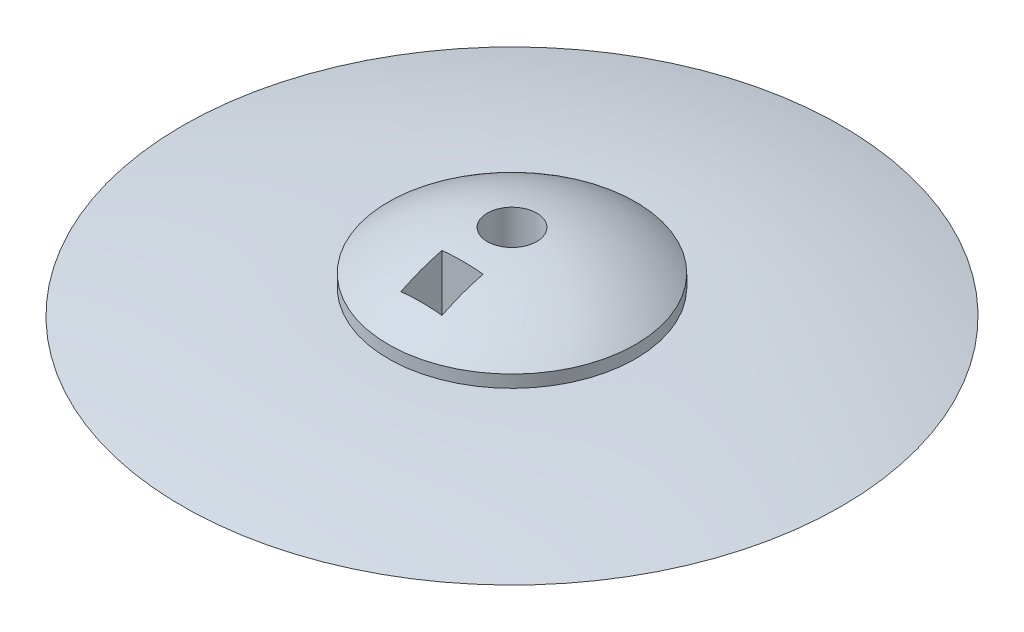
ISO-10303-21;
HEADER;
FILE_DESCRIPTION(('STEP AP214'),'2;1');
FILE_NAME('part.step','',(''),(''),'','','');
FILE_SCHEMA(('AUTOMOTIVE_DESIGN { 1 0 10303 214 1 1 1 1 }'));
ENDSEC;
DATA;
#1=APPLICATION_CONTEXT('core data for automotive mechanical design processes');
#2=APPLICATION_PROTOCOL_DEFINITION('international standard','automotive_design',2000,#1);
#3=PRODUCT_CONTEXT('',#1,'mechanical');
#4=PRODUCT('Part','Part','',(#3));
#5=PRODUCT_RELATED_PRODUCT_CATEGORY('part','',(#4));
#6=PRODUCT_DEFINITION_FORMATION('','',#4);
#7=PRODUCT_DEFINITION_CONTEXT('part definition',#1,'design');
#8=PRODUCT_DEFINITION('design','',#6,#7);
#9=PRODUCT_DEFINITION_SHAPE('','',#8);
#10=(LENGTH_UNIT() NAMED_UNIT(*) SI_UNIT(.MILLI.,.METRE.));
#11=(NAMED_UNIT(*) PLANE_ANGLE_UNIT() SI_UNIT($,.RADIAN.));
#12=(NAMED_UNIT(*) SI_UNIT($,.STERADIAN.) SOLID_ANGLE_UNIT());
#13=UNCERTAINTY_MEASURE_WITH_UNIT(LENGTH_MEASURE(1.E-05),#10,'distance_accuracy_value','');
#14=(GEOMETRIC_REPRESENTATION_CONTEXT(3) GLOBAL_UNCERTAINTY_ASSIGNED_CONTEXT((#13)) GLOBAL_UNIT_ASSIGNED_CONTEXT((#10,
#11,#12)) REPRESENTATION_CONTEXT('',''));
#15=CARTESIAN_POINT('',(0.,0.,0.));
#16=DIRECTION('',(0.,0.,1.));
#17=DIRECTION('',(1.,0.,0.));
#18=AXIS2_PLACEMENT_3D('',#15,#16,#17);
#19=CARTESIAN_POINT('',(0.,19.05,0.));
#20=DIRECTION('',(0.,-1.,0.));
#21=DIRECTION('',(1.,0.,0.));
#22=AXIS2_PLACEMENT_3D('',#19,#20,#21);
#23=CYLINDRICAL_SURFACE('',#22,3.81);
#24=CARTESIAN_POINT('',(0.,18.8205710608168,0.));
#25=DIRECTION('',(0.,-1.,0.));
#26=DIRECTION('',(1.,0.,0.));
#27=AXIS2_PLACEMENT_3D('',#24,#25,#26);
#28=CIRCLE('',#27,3.81);
#29=CARTESIAN_POINT('',(3.81,18.8205710608168,0.));
#30=VERTEX_POINT('',#29);
#31=EDGE_CURVE('E110',#30,#30,#28,.F.);
#32=ORIENTED_EDGE('',*,*,#31,.T.);
#33=EDGE_LOOP('',(#32));
#34=FACE_BOUND('',#33,.T.);
#35=CARTESIAN_POINT('',(0.,0.638751879125377,0.));
#36=DIRECTION('',(0.,1.,0.));
#37=DIRECTION('',(-1.,0.,0.));
#38=AXIS2_PLACEMENT_3D('',#35,#36,#37);
#39=CIRCLE('',#38,3.81);
#40=CARTESIAN_POINT('',(-3.81,0.638751879125377,0.));
#41=VERTEX_POINT('',#40);
#42=EDGE_CURVE('E105',#41,#41,#39,.F.);
#43=ORIENTED_EDGE('',*,*,#42,.T.);
#44=EDGE_LOOP('',(#43));
#45=FACE_BOUND('',#44,.T.);
#46=CARTESIAN_POINT('',(1.84450831863129,5.08,3.33375));
#47=CARTESIAN_POINT('',(1.84450485690147,4.97495957982358,3.33375667884058));
#48=CARTESIAN_POINT('',(1.83663504261278,4.86980296629292,3.33814394288497));
#49=CARTESIAN_POINT('',(1.8052511738438,4.66242101605275,3.35521580649338));
#50=CARTESIAN_POINT('',(1.78170911181393,4.56020126952595,3.36791525991533));
#51=CARTESIAN_POINT('',(1.71939778935129,4.36183647030819,3.4001457989546));
#52=CARTESIAN_POINT('',(1.68065346990357,4.26568176565757,3.41966568917617));
#53=CARTESIAN_POINT('',(1.5885835744515,4.08183214581293,3.46339243590433));
#54=CARTESIAN_POINT('',(1.53526129365898,3.99413532484628,3.48759823284501));
#55=CARTESIAN_POINT('',(1.41398427515898,3.82805396695452,3.53852098701009));
#56=CARTESIAN_POINT('',(1.34581071222825,3.74983933828346,3.56527170503102));
#57=CARTESIAN_POINT('',(1.19668563983482,3.60639097370986,3.61805011069635));
#58=CARTESIAN_POINT('',(1.11573356157362,3.54115781593215,3.64407776609505));
#59=CARTESIAN_POINT('',(0.943608465451337,3.42591076716566,3.6923730850343));
#60=CARTESIAN_POINT('',(0.8525225861647,3.37577906298058,3.71466921792614));
#61=CARTESIAN_POINT('',(0.66205787037869,3.29150991533011,3.75329208711571));
#62=CARTESIAN_POINT('',(0.562681968839975,3.25736683940039,3.76962092512264));
#63=CARTESIAN_POINT('',(0.363975533301578,3.20746913104421,3.79382628797596));
#64=CARTESIAN_POINT('',(0.26490888480565,3.19085419123302,3.8020965553522));
#65=CARTESIAN_POINT('',(0.0650639188767099,3.17346841726746,3.81075560099529));
#66=CARTESIAN_POINT('',(-0.0357139298198702,3.17269331212266,3.81114650382247));
#67=CARTESIAN_POINT('',(-0.2317060868341,3.18670394305774,3.80416062344571));
#68=CARTESIAN_POINT('',(-0.326978572868285,3.20085002508652,3.79710313703066));
#69=CARTESIAN_POINT('',(-0.513553278900913,3.24331305970202,3.77639712415501));
#70=CARTESIAN_POINT('',(-0.604855484463092,3.27163006381069,3.76274857373096));
#71=CARTESIAN_POINT('',(-0.781996051852397,3.34202720406553,3.72998415400345));
#72=CARTESIAN_POINT('',(-0.867771491637588,3.38424060459465,3.71081558067993));
#73=CARTESIAN_POINT('',(-1.03086876907161,3.48129315189791,3.66885684881573));
#74=CARTESIAN_POINT('',(-1.10818873910302,3.53613507974701,3.64606589289101));
#75=CARTESIAN_POINT('',(-1.25643409152258,3.66022302424384,3.59775726408616));
#76=CARTESIAN_POINT('',(-1.32684445585705,3.73005339420716,3.57216017023125));
#77=CARTESIAN_POINT('',(-1.45526450553079,3.88058359872348,3.52179991827897));
#78=CARTESIAN_POINT('',(-1.51327085199886,3.96128635036221,3.49703698622581));
#79=CARTESIAN_POINT('',(-1.61814451808316,4.13541078307971,3.44980724644181));
#80=CARTESIAN_POINT('',(-1.66441235918467,4.22923483692372,3.4274885997958));
#81=CARTESIAN_POINT('',(-1.74155317654316,4.4241850780795,3.38894732879071));
#82=CARTESIAN_POINT('',(-1.77242671411818,4.52531099899145,3.37272448216756));
#83=CARTESIAN_POINT('',(-1.81820540356248,4.73177739303201,3.34826956312067));
#84=CARTESIAN_POINT('',(-1.83315195664297,4.83710619708719,3.34001677827921));
#85=CARTESIAN_POINT('',(-1.84696197853558,5.04912437316591,3.33240118098069));
#86=CARTESIAN_POINT('',(-1.84582755520348,5.15581356504146,3.33303720339996));
#87=CARTESIAN_POINT('',(-1.82770236707949,5.3650635864275,3.34300790332365));
#88=CARTESIAN_POINT('',(-1.81105714882204,5.4676637328227,3.35215301043595));
#89=CARTESIAN_POINT('',(-1.7626725566967,5.6682718040062,3.37784371993086));
#90=CARTESIAN_POINT('',(-1.73093203987156,5.76627938044561,3.39438988268696));
#91=CARTESIAN_POINT('',(-1.65250096886245,5.95598204357754,3.43325839795897));
#92=CARTESIAN_POINT('',(-1.60567466149725,6.0476102514737,3.45563283348314));
#93=CARTESIAN_POINT('',(-1.49793524768189,6.22122715231448,3.50367787490109));
#94=CARTESIAN_POINT('',(-1.43701989192785,6.30321430291703,3.52934900681812));
#95=CARTESIAN_POINT('',(-1.30081825284457,6.45706107432266,3.58181432889784));
#96=CARTESIAN_POINT('',(-1.22526430981437,6.5286801513278,3.60862074514845));
#97=CARTESIAN_POINT('',(-1.06225217787024,6.6578432554888,3.65991888308245));
#98=CARTESIAN_POINT('',(-0.974795266905234,6.71538879178217,3.68441085277619));
#99=CARTESIAN_POINT('',(-0.792277721982926,6.8136481918348,3.72786666133346));
#100=CARTESIAN_POINT('',(-0.697432841291562,6.85471212243134,3.74694263530313));
#101=CARTESIAN_POINT('',(-0.501188586203321,6.92058979309999,3.77819568149009));
#102=CARTESIAN_POINT('',(-0.399791694114236,6.94540964823184,3.79037534957907));
#103=CARTESIAN_POINT('',(-0.19936145619968,6.97711501188611,3.80603480550194));
#104=CARTESIAN_POINT('',(-0.100506765752344,6.98491514920616,3.80995785031155));
#105=CARTESIAN_POINT('',(0.0972089253695492,6.98508342375894,3.81004143622459));
#106=CARTESIAN_POINT('',(0.196069921104734,6.97745455267239,3.8062034821837));
#107=CARTESIAN_POINT('',(0.387986247832529,6.94744703769766,3.7913807313503));
#108=CARTESIAN_POINT('',(0.481126807369104,6.9255041253209,3.78060718336952));
#109=CARTESIAN_POINT('',(0.662130757989706,6.86789961892237,3.7531410298415));
#110=CARTESIAN_POINT('',(0.749993737115049,6.8322369555656,3.73644796292729));
#111=CARTESIAN_POINT('',(0.920326547934199,6.74708916107425,3.69822988239512));
#112=CARTESIAN_POINT('',(1.002617060096,6.69729374694641,3.676598821668));
#113=CARTESIAN_POINT('',(1.1576177088484,6.58548606746018,3.63078003479306));
#114=CARTESIAN_POINT('',(1.23032596857911,6.52347141465726,3.60659180944473));
#115=CARTESIAN_POINT('',(1.36839433409533,6.38499920952268,3.55658264065951));
#116=CARTESIAN_POINT('',(1.43314958966442,6.30794460364378,3.53074380896368));
#117=CARTESIAN_POINT('',(1.54931880767525,6.14365242816526,3.48133735676198));
#118=CARTESIAN_POINT('',(1.60072492060363,6.05640891082944,3.45777107765046));
#119=CARTESIAN_POINT('',(1.69080210391312,5.87081970569292,3.41465595160386));
#120=CARTESIAN_POINT('',(1.72898387382655,5.77219839404328,3.39526986111089));
#121=CARTESIAN_POINT('',(1.78942298838729,5.56921451450615,3.36381388446616));
#122=CARTESIAN_POINT('',(1.81171040925096,5.46486319461244,3.35173018695062));
#123=CARTESIAN_POINT('',(1.83209478699778,5.31303201091727,3.34059367416096));
#124=CARTESIAN_POINT('',(1.83674682003083,5.2665916832096,3.33803446016504));
#125=CARTESIAN_POINT('',(1.84295436652178,5.17344190450239,3.33461113156774));
#126=CARTESIAN_POINT('',(1.84450985875385,5.12673245166026,3.33374702858581));
#127=CARTESIAN_POINT('',(1.84450831863129,5.08,3.33375));
#128=B_SPLINE_CURVE_WITH_KNOTS('',3,(#46,#47,#48,#49,#50,#51,#52,#53,#54,#55,#56,#57,#58,#59,
#60,#61,#62,#63,#64,#65,#66,#67,#68,#69,#70,#71,#72,#73,#74,#75,#76,#77,#78,#79,#80,#81,#82,#83,
#84,#85,#86,#87,#88,#89,#90,#91,#92,#93,#94,#95,#96,#97,#98,#99,#100,#101,#102,#103,#104,#105,
#106,#107,#108,#109,#110,#111,#112,#113,#114,#115,#116,#117,#118,#119,#120,#121,#122,#123,#124,
#125,#126,#127),.UNSPECIFIED.,.T.,.F.,(4,2,2,2,2,2,2,2,2,2,2,2,2,2,2,2,2,2,2,2,2,2,2,2,2,2,2,2,
2,2,2,2,2,2,2,2,2,2,2,2,4),(0.,0.31494295189275,0.630450248140965,0.945442069652593,
1.26036274899366,1.58028213742867,1.90021577016374,2.21758465255067,2.53484164815617,
2.83567754593717,3.13643232644486,3.42479866710733,3.71316605620569,4.00438358060209,
4.29566529883627,4.60155207819422,4.90752109175442,5.22689734709262,5.54626195625501,
5.8647943564509,6.18328500457049,6.49484578881822,6.80643016699233,7.12090063024874,
7.43542133312796,7.75635411231235,8.07725246204692,8.39091963275994,8.70446865587854,
9.00070399555714,9.29688190078757,9.58443999741617,9.87202051123412,10.1664812455013,
10.4609995698566,10.7713449179785,11.0818723430982,11.4028980400582,11.7233146498969,
11.8634317149623,12.0035497404838),.UNSPECIFIED.);
#129=CARTESIAN_POINT('',(1.84450831863129,5.08,3.33375));
#130=VERTEX_POINT('',#129);
#131=EDGE_CURVE('E11',#130,#130,#128,.T.);
#132=ORIENTED_EDGE('',*,*,#131,.F.);
#133=EDGE_LOOP('',(#132));
#134=FACE_BOUND('',#133,.T.);
#135=ADVANCED_FACE('F39',(#34,#45,#134),#23,.F.);
#136=CARTESIAN_POINT('',(0.,-12.7,0.));
#137=DIRECTION('',(0.,-1.,0.));
#138=DIRECTION('',(1.,0.,0.));
#139=AXIS2_PLACEMENT_3D('',#136,#137,#138);
#140=SPHERICAL_SURFACE('',#139,31.75);
#141=ORIENTED_EDGE('',*,*,#31,.F.);
#142=EDGE_LOOP('',(#141));
#143=FACE_BOUND('',#142,.T.);
#144=CARTESIAN_POINT('',(3.175,-12.7,0.));
#145=DIRECTION('',(1.,0.,0.));
#146=DIRECTION('',(0.,1.,0.));
#147=AXIS2_PLACEMENT_3D('',#144,#145,#146);
#148=CIRCLE('',#147,31.5908511281352);
#149=CARTESIAN_POINT('',(3.175,15.6340956270003,13.97));
#150=VERTEX_POINT('',#149);
#151=CARTESIAN_POINT('',(3.175,17.9580735696162,7.62));
#152=VERTEX_POINT('',#151);
#153=EDGE_CURVE('E95',#150,#152,#148,.F.);
#154=ORIENTED_EDGE('',*,*,#153,.F.);
#155=CARTESIAN_POINT('',(0.,-12.7,13.97));
#156=DIRECTION('',(0.,0.,1.));
#157=DIRECTION('',(1.,0.,0.));
#158=AXIS2_PLACEMENT_3D('',#155,#156,#157);
#159=CIRCLE('',#158,28.5114292872174);
#160=CARTESIAN_POINT('',(-3.175,15.6340956270003,13.97));
#161=VERTEX_POINT('',#160);
#162=EDGE_CURVE('E83',#161,#150,#159,.F.);
#163=ORIENTED_EDGE('',*,*,#162,.F.);
#164=CARTESIAN_POINT('',(-3.175,-12.7,0.));
#165=DIRECTION('',(-1.,0.,0.));
#166=DIRECTION('',(0.,-1.,0.));
#167=AXIS2_PLACEMENT_3D('',#164,#165,#166);
#168=CIRCLE('',#167,31.5908511281352);
#169=CARTESIAN_POINT('',(-3.175,17.9580735696162,7.62));
#170=VERTEX_POINT('',#169);
#171=EDGE_CURVE('E89',#170,#161,#168,.F.);
#172=ORIENTED_EDGE('',*,*,#171,.F.);
#173=CARTESIAN_POINT('',(0.,-12.7,7.62));
#174=DIRECTION('',(0.,0.,-1.));
#175=DIRECTION('',(-1.,0.,0.));
#176=AXIS2_PLACEMENT_3D('',#173,#174,#175);
#177=CIRCLE('',#176,30.8220391927594);
#178=EDGE_CURVE('E103',#152,#170,#177,.F.);
#179=ORIENTED_EDGE('',*,*,#178,.F.);
#180=EDGE_LOOP('',(#154,#163,#172,#179));
#181=FACE_BOUND('',#180,.T.);
#182=CARTESIAN_POINT('',(0.,12.7,0.));
#183=DIRECTION('',(0.,-1.,0.));
#184=DIRECTION('',(1.,0.,0.));
#185=AXIS2_PLACEMENT_3D('',#182,#183,#184);
#186=CIRCLE('',#185,19.05);
#187=CARTESIAN_POINT('',(19.05,12.7,0.));
#188=VERTEX_POINT('',#187);
#189=EDGE_CURVE('E133',#188,#188,#186,.T.);
#190=ORIENTED_EDGE('',*,*,#189,.F.);
#191=EDGE_LOOP('',(#190));
#192=FACE_BOUND('',#191,.T.);
#193=ADVANCED_FACE('F41',(#143,#181,#192),#140,.T.);
#194=CARTESIAN_POINT('',(0.,0.,0.));
#195=DIRECTION('',(0.,-1.,0.));
#196=DIRECTION('',(1.,0.,0.));
#197=AXIS2_PLACEMENT_3D('',#194,#195,#196);
#198=CYLINDRICAL_SURFACE('',#197,19.05);
#199=ORIENTED_EDGE('',*,*,#189,.T.);
#200=EDGE_LOOP('',(#199));
#201=FACE_BOUND('',#200,.T.);
#202=CARTESIAN_POINT('',(0.,10.795,0.));
#203=DIRECTION('',(0.,-1.,0.));
#204=DIRECTION('',(1.,0.,0.));
#205=AXIS2_PLACEMENT_3D('',#202,#203,#204);
#206=CIRCLE('',#205,19.05);
#207=CARTESIAN_POINT('',(19.05,10.795,0.));
#208=VERTEX_POINT('',#207);
#209=EDGE_CURVE('E129',#208,#208,#206,.T.);
#210=ORIENTED_EDGE('',*,*,#209,.F.);
#211=EDGE_LOOP('',(#210));
#212=FACE_BOUND('',#211,.T.);
#213=ADVANCED_FACE('F239',(#201,#212),#198,.T.);
#214=CARTESIAN_POINT('',(0.,-123.401666666666,0.));
#215=DIRECTION('',(0.,-1.,0.));
#216=DIRECTION('',(1.,0.,0.));
#217=AXIS2_PLACEMENT_3D('',#214,#215,#216);
#218=DEGENERATE_TOROIDAL_SURFACE('',#217,19.05,134.196666666666,.T.);
#219=ORIENTED_EDGE('',*,*,#209,.T.);
#220=EDGE_LOOP('',(#219));
#221=FACE_BOUND('',#220,.T.);
#222=CARTESIAN_POINT('',(0.,6.985,0.));
#223=DIRECTION('',(0.,-1.,0.));
#224=DIRECTION('',(1.,0.,0.));
#225=AXIS2_PLACEMENT_3D('',#222,#223,#224);
#226=CIRCLE('',#225,50.8);
#227=CARTESIAN_POINT('',(50.8,6.985,0.));
#228=VERTEX_POINT('',#227);
#229=EDGE_CURVE('E125',#228,#228,#226,.T.);
#230=ORIENTED_EDGE('',*,*,#229,.F.);
#231=EDGE_LOOP('',(#230));
#232=FACE_BOUND('',#231,.T.);
#233=ADVANCED_FACE('F231',(#221,#232),#218,.T.);
#234=CARTESIAN_POINT('',(0.,137.371666666666,0.));
#235=DIRECTION('',(0.,-1.,0.));
#236=DIRECTION('',(1.,0.,0.));
#237=AXIS2_PLACEMENT_3D('',#234,#235,#236);
#238=DEGENERATE_TOROIDAL_SURFACE('',#237,19.05,134.196666666666,.T.);
#239=ORIENTED_EDGE('',*,*,#229,.T.);
#240=EDGE_LOOP('',(#239));
#241=FACE_BOUND('',#240,.T.);
#242=CARTESIAN_POINT('',(0.,3.17499999999998,0.));
#243=DIRECTION('',(0.,-1.,0.));
#244=DIRECTION('',(1.,0.,0.));
#245=AXIS2_PLACEMENT_3D('',#242,#243,#244);
#246=CIRCLE('',#245,19.05);
#247=CARTESIAN_POINT('',(19.05,3.17499999999998,0.));
#248=VERTEX_POINT('',#247);
#249=EDGE_CURVE('E121',#248,#248,#246,.T.);
#250=ORIENTED_EDGE('',*,*,#249,.F.);
#251=EDGE_LOOP('',(#250));
#252=FACE_BOUND('',#251,.T.);
#253=ADVANCED_FACE('F224',(#241,#252),#238,.T.);
#254=CARTESIAN_POINT('',(0.,0.,0.));
#255=DIRECTION('',(0.,-1.,0.));
#256=DIRECTION('',(1.,0.,0.));
#257=AXIS2_PLACEMENT_3D('',#254,#255,#256);
#258=CYLINDRICAL_SURFACE('',#257,19.05);
#259=ORIENTED_EDGE('',*,*,#249,.T.);
#260=EDGE_LOOP('',(#259));
#261=FACE_BOUND('',#260,.T.);
#262=CARTESIAN_POINT('',(0.,1.27,0.));
#263=DIRECTION('',(0.,-1.,0.));
#264=DIRECTION('',(1.,0.,0.));
#265=AXIS2_PLACEMENT_3D('',#262,#263,#264);
#266=CIRCLE('',#265,19.05);
#267=CARTESIAN_POINT('',(19.05,1.27,0.));
#268=VERTEX_POINT('',#267);
#269=EDGE_CURVE('E117',#268,#268,#266,.T.);
#270=ORIENTED_EDGE('',*,*,#269,.F.);
#271=EDGE_LOOP('',(#270));
#272=FACE_BOUND('',#271,.T.);
#273=ADVANCED_FACE('F216',(#261,#272),#258,.T.);
#274=CARTESIAN_POINT('',(0.,215.582500000007,0.));
#275=DIRECTION('',(0.,-1.,0.));
#276=DIRECTION('',(1.,0.,0.));
#277=AXIS2_PLACEMENT_3D('',#274,#275,#276);
#278=DEGENERATE_TOROIDAL_SURFACE('',#277,2.54,214.947500000007,.T.);
#279=ORIENTED_EDGE('',*,*,#42,.F.);
#280=EDGE_LOOP('',(#279));
#281=FACE_BOUND('',#280,.T.);
#282=CARTESIAN_POINT('',(3.175,0.636752065188605,1.23812898058823));
#283=CARTESIAN_POINT('',(3.175,0.637164448259013,1.52210864355336));
#284=CARTESIAN_POINT('',(3.175,0.63778279088176,1.80608821100459));
#285=CARTESIAN_POINT('',(3.175,0.639617154586712,2.37404472379576));
#286=CARTESIAN_POINT('',(3.175,0.64083317435017,2.6580216691401));
#287=CARTESIAN_POINT('',(3.175,0.645656728011568,3.51000639647914));
#288=CARTESIAN_POINT('',(3.175,0.650439747722854,4.07800847686724));
#289=CARTESIAN_POINT('',(3.175,0.663907664854034,5.21429069613779));
#290=CARTESIAN_POINT('',(3.175,0.67259477929062,5.78257080949005));
#291=CARTESIAN_POINT('',(3.175,0.694164393825613,6.91905163436281));
#292=CARTESIAN_POINT('',(3.175,0.707046902225045,7.48725234572398));
#293=CARTESIAN_POINT('',(3.175,0.752207104840167,9.19170126642365));
#294=CARTESIAN_POINT('',(3.175,0.790997352068051,10.3277851624842));
#295=CARTESIAN_POINT('',(3.175,0.886348417419106,12.5991394888651));
#296=CARTESIAN_POINT('',(3.175,0.942908270409936,13.73440996001));
#297=CARTESIAN_POINT('',(3.175,1.07390357586904,16.0039026830258));
#298=CARTESIAN_POINT('',(3.175,1.14833862792265,17.1381249578058));
#299=CARTESIAN_POINT('',(3.175,1.25724583351075,18.6185088993154));
#300=CARTESIAN_POINT('',(3.175,1.28359986884597,18.9652803937067));
#301=CARTESIAN_POINT('',(3.175,1.33798434876787,19.6586811148859));
#302=CARTESIAN_POINT('',(3.175,1.36601474150613,20.0053103457405));
#303=CARTESIAN_POINT('',(3.175,1.39488382248361,20.3518710194118));
#304=B_SPLINE_CURVE_WITH_KNOTS('',3,(#282,#283,#284,#285,#286,#287,#288,#289,#290,#291,#292,
#293,#294,#295,#296,#297,#298,#299,#300,#301,#302,#303),.UNSPECIFIED.,.F.,.F.,(4,2,2,2,2,2,2,2,
2,2,4),(0.,0.851940026993077,1.7038781742272,3.40793324537895,5.11295722274075,6.81798457369035,
10.2280725739496,13.6379753918563,17.0478018331171,18.0911135127384,19.1343929402163),.UNSPECIFIED.);
#305=CARTESIAN_POINT('',(3.175,0.710988320926989,7.62));
#306=VERTEX_POINT('',#305);
#307=CARTESIAN_POINT('',(3.17499999998456,0.958382071733302,13.97));
#308=VERTEX_POINT('',#307);
#309=EDGE_CURVE('E53',#306,#308,#304,.T.);
#310=ORIENTED_EDGE('',*,*,#309,.F.);
#311=CARTESIAN_POINT('',(-9.55687101941177,0.853205128924648,7.62));
#312=CARTESIAN_POINT('',(-9.04736694067312,0.835234158952985,7.62));
#313=CARTESIAN_POINT('',(-8.53780457040987,0.818943601130382,7.62));
#314=CARTESIAN_POINT('',(-7.51858958133881,0.789592792878166,7.62));
#315=CARTESIAN_POINT('',(-7.00893696306341,0.776532523988091,7.62));
#316=CARTESIAN_POINT('',(-5.98956938565687,0.753511741331376,7.62));
#317=CARTESIAN_POINT('',(-5.47985442753786,0.743551182579588,7.62));
#318=CARTESIAN_POINT('',(-4.46037602436344,0.726554492240761,7.62));
#319=CARTESIAN_POINT('',(-3.95061257924434,0.719518364550027,7.62));
#320=CARTESIAN_POINT('',(-2.42164265103105,0.702456197364192,7.62));
#321=CARTESIAN_POINT('',(-1.40238848764771,0.69646837439253,7.62));
#322=CARTESIAN_POINT('',(0.126495596809321,0.694664362994788,7.62));
#323=CARTESIAN_POINT('',(0.636125907314031,0.695259327891017,7.62));
#324=CARTESIAN_POINT('',(1.65537782891867,0.69890059262657,7.62));
#325=CARTESIAN_POINT('',(2.16499944003194,0.701946888294366,7.62));
#326=CARTESIAN_POINT('',(3.24820358225854,0.711190931021181,7.62));
#327=CARTESIAN_POINT('',(3.82178320291763,0.717736329833887,7.62));
#328=CARTESIAN_POINT('',(4.96888475552411,0.734427258056155,7.62));
#329=CARTESIAN_POINT('',(5.5424066880039,0.744572750458096,7.62));
#330=CARTESIAN_POINT('',(6.68948300191234,0.76874131075022,7.62));
#331=CARTESIAN_POINT('',(7.26303736733195,0.782765144998229,7.62));
#332=CARTESIAN_POINT('',(8.4100427372904,0.814883581912772,7.62));
#333=CARTESIAN_POINT('',(8.98349373966834,0.832978261592738,7.62));
#334=CARTESIAN_POINT('',(9.55687101941177,0.853205128924619,7.62));
#335=B_SPLINE_CURVE_WITH_KNOTS('',3,(#311,#312,#313,#314,#315,#316,#317,#318,#319,#320,#321,
#322,#323,#324,#325,#326,#327,#328,#329,#330,#331,#332,#333,#334),.UNSPECIFIED.,.F.,.F.,(4,2,2,
2,2,2,2,2,2,2,2,4),(0.,1.52945850062833,3.05890826050216,4.58833582290284,6.11776542299827,
9.17552015695002,10.7044083786471,12.2332939985794,13.9541345320142,15.6749573763616,
17.3961204974396,19.117316182718),.UNSPECIFIED.);
#336=CARTESIAN_POINT('',(-3.175,0.710988320927006,7.62));
#337=VERTEX_POINT('',#336);
#338=EDGE_CURVE('E172',#337,#306,#335,.T.);
#339=ORIENTED_EDGE('',*,*,#338,.F.);
#340=CARTESIAN_POINT('',(-3.175,1.39488382248362,20.3518710194118));
#341=CARTESIAN_POINT('',(-3.175,1.32868084517738,19.5571537874065));
#342=CARTESIAN_POINT('',(-3.175,1.26689096346016,18.7620691185354));
#343=CARTESIAN_POINT('',(-3.175,1.1521267691735,17.1712597370884));
#344=CARTESIAN_POINT('',(-3.175,1.099152501133,16.3755350213));
#345=CARTESIAN_POINT('',(-3.175,1.00203169434276,14.7839108058663));
#346=CARTESIAN_POINT('',(-3.175,0.957881147487458,13.9880115507341));
#347=CARTESIAN_POINT('',(-3.175,0.878350239191124,12.395778518779));
#348=CARTESIAN_POINT('',(-3.175,0.842969839572115,11.5994447438628));
#349=CARTESIAN_POINT('',(-3.175,0.780918263543551,10.0064753192052));
#350=CARTESIAN_POINT('',(-3.175,0.754246686616652,9.20983968503367));
#351=CARTESIAN_POINT('',(-3.175,0.709479233039968,7.61632096911027));
#352=CARTESIAN_POINT('',(-3.175,0.6913834198585,6.81943788557069));
#353=CARTESIAN_POINT('',(-3.175,0.67037504714254,5.62382835537037));
#354=CARTESIAN_POINT('',(-3.175,0.66439414765637,5.22515304021823));
#355=CARTESIAN_POINT('',(-3.175,0.654360517915848,4.4277769052119));
#356=CARTESIAN_POINT('',(-3.175,0.650307792300468,4.02907608529864));
#357=CARTESIAN_POINT('',(-3.175,0.643938665518557,3.23166890674372));
#358=CARTESIAN_POINT('',(-3.175,0.641622231383974,2.83296254835098));
#359=CARTESIAN_POINT('',(-3.175,0.638305288911909,2.03554683696497));
#360=CARTESIAN_POINT('',(-3.175,0.637304771629302,1.63683748401048));
#361=CARTESIAN_POINT('',(-3.175,0.636752065188613,1.23812898058823));
#362=B_SPLINE_CURVE_WITH_KNOTS('',3,(#340,#341,#342,#343,#344,#345,#346,#347,#348,#349,#350,
#351,#352,#353,#354,#355,#356,#357,#358,#359,#360,#361),.UNSPECIFIED.,.F.,.F.,(4,2,2,2,2,2,2,2,
2,2,4),(0.,2.39239727522849,4.78480663443632,7.17612677820168,9.56743651195313,11.958636254263,
14.3498536933119,15.5460103279926,16.7421698404789,17.9383066401612,19.1344353088968),.UNSPECIFIED.);
#363=CARTESIAN_POINT('',(-3.175,0.958382071733481,13.97));
#364=VERTEX_POINT('',#363);
#365=EDGE_CURVE('E146',#364,#337,#362,.T.);
#366=ORIENTED_EDGE('',*,*,#365,.F.);
#367=CARTESIAN_POINT('',(9.55687101941177,1.11696352838999,13.97));
#368=CARTESIAN_POINT('',(8.85058902818651,1.09021014789145,13.97));
#369=CARTESIAN_POINT('',(8.14419298017589,1.06659587547871,13.97));
#370=CARTESIAN_POINT('',(6.73122592363242,1.02547453497298,13.97));
#371=CARTESIAN_POINT('',(6.02465491586102,1.00796744075285,13.97));
#372=CARTESIAN_POINT('',(3.90470339922632,0.964349146631412,13.97));
#373=CARTESIAN_POINT('',(2.49113109620723,0.947142681332384,13.97));
#374=CARTESIAN_POINT('',(-0.335200034184759,0.935517560432246,13.97));
#375=CARTESIAN_POINT('',(-1.74795881064579,0.941084500135278,13.97));
#376=CARTESIAN_POINT('',(-4.57316879293945,0.975329059004151,13.97));
#377=CARTESIAN_POINT('',(-5.98562000745859,1.00400590738797,13.97));
#378=CARTESIAN_POINT('',(-7.75759866112254,1.05529011149864,13.97));
#379=CARTESIAN_POINT('',(-8.11747391089806,1.06649817743433,13.97));
#380=CARTESIAN_POINT('',(-8.83719959746817,1.09052070904748,13.97));
#381=CARTESIAN_POINT('',(-9.1970500299744,1.10333530316792,13.97));
#382=CARTESIAN_POINT('',(-9.55687101941177,1.11696352839002,13.97));
#383=B_SPLINE_CURVE_WITH_KNOTS('',3,(#367,#368,#369,#370,#371,#372,#373,#374,#375,#376,#377,
#378,#379,#380,#381,#382),.UNSPECIFIED.,.F.,.F.,(4,2,2,2,2,2,2,4),(0.,2.12034973236399,
4.2406903935412,8.48151189291954,12.7196513912768,16.9576495413233,18.0377964644571,
19.1180298011888),.UNSPECIFIED.);
#384=EDGE_CURVE('E137',#308,#364,#383,.T.);
#385=ORIENTED_EDGE('',*,*,#384,.F.);
#386=EDGE_LOOP('',(#310,#339,#366,#385));
#387=FACE_BOUND('',#386,.T.);
#388=ORIENTED_EDGE('',*,*,#269,.T.);
#389=EDGE_LOOP('',(#388));
#390=FACE_BOUND('',#389,.T.);
#391=ADVANCED_FACE('F153',(#281,#387,#390),#278,.T.);
#392=CARTESIAN_POINT('',(3.175,19.05,7.62));
#393=DIRECTION('',(1.,0.,0.));
#394=DIRECTION('',(0.,1.,0.));
#395=AXIS2_PLACEMENT_3D('',#392,#393,#394);
#396=PLANE('',#395);
#397=ORIENTED_EDGE('',*,*,#153,.T.);
#398=DIRECTION('',(0.,-1.,0.));
#399=VECTOR('',#398,1.);
#400=CARTESIAN_POINT('',(3.175,19.05,7.62));
#401=LINE('',#400,#399);
#402=EDGE_CURVE('E90',#152,#306,#401,.T.);
#403=ORIENTED_EDGE('',*,*,#402,.T.);
#404=ORIENTED_EDGE('',*,*,#309,.T.);
#405=DIRECTION('',(0.,-1.,0.));
#406=VECTOR('',#405,1.);
#407=CARTESIAN_POINT('',(3.175,19.05,13.97));
#408=LINE('',#407,#406);
#409=EDGE_CURVE('E65',#150,#308,#408,.T.);
#410=ORIENTED_EDGE('',*,*,#409,.F.);
#411=EDGE_LOOP('',(#397,#403,#404,#410));
#412=FACE_BOUND('',#411,.T.);
#413=ADVANCED_FACE('F93',(#412),#396,.F.);
#414=CARTESIAN_POINT('',(3.175,19.05,7.62));
#415=DIRECTION('',(0.,0.,-1.));
#416=DIRECTION('',(-1.,0.,0.));
#417=AXIS2_PLACEMENT_3D('',#414,#415,#416);
#418=PLANE('',#417);
#419=ORIENTED_EDGE('',*,*,#178,.T.);
#420=DIRECTION('',(0.,-1.,0.));
#421=VECTOR('',#420,1.);
#422=CARTESIAN_POINT('',(-3.175,19.05,7.62));
#423=LINE('',#422,#421);
#424=EDGE_CURVE('E293',#170,#337,#423,.T.);
#425=ORIENTED_EDGE('',*,*,#424,.T.);
#426=ORIENTED_EDGE('',*,*,#338,.T.);
#427=ORIENTED_EDGE('',*,*,#402,.F.);
#428=EDGE_LOOP('',(#419,#425,#426,#427));
#429=FACE_BOUND('',#428,.T.);
#430=ADVANCED_FACE('F165',(#429),#418,.F.);
#431=CARTESIAN_POINT('',(-3.175,19.05,7.62));
#432=DIRECTION('',(-1.,0.,0.));
#433=DIRECTION('',(0.,-1.,0.));
#434=AXIS2_PLACEMENT_3D('',#431,#432,#433);
#435=PLANE('',#434);
#436=ORIENTED_EDGE('',*,*,#171,.T.);
#437=DIRECTION('',(0.,-1.,0.));
#438=VECTOR('',#437,1.);
#439=CARTESIAN_POINT('',(-3.175,19.05,13.97));
#440=LINE('',#439,#438);
#441=EDGE_CURVE('E60',#161,#364,#440,.T.);
#442=ORIENTED_EDGE('',*,*,#441,.T.);
#443=ORIENTED_EDGE('',*,*,#365,.T.);
#444=ORIENTED_EDGE('',*,*,#424,.F.);
#445=EDGE_LOOP('',(#436,#442,#443,#444));
#446=FACE_BOUND('',#445,.T.);
#447=ADVANCED_FACE('F160',(#446),#435,.F.);
#448=CARTESIAN_POINT('',(3.175,19.05,13.97));
#449=DIRECTION('',(0.,0.,1.));
#450=DIRECTION('',(1.,0.,0.));
#451=AXIS2_PLACEMENT_3D('',#448,#449,#450);
#452=PLANE('',#451);
#453=ORIENTED_EDGE('',*,*,#162,.T.);
#454=ORIENTED_EDGE('',*,*,#409,.T.);
#455=ORIENTED_EDGE('',*,*,#384,.T.);
#456=ORIENTED_EDGE('',*,*,#441,.F.);
#457=EDGE_LOOP('',(#453,#454,#455,#456));
#458=FACE_BOUND('',#457,.T.);
#459=ADVANCED_FACE('F84',(#458),#452,.F.);
#460=CARTESIAN_POINT('',(0.,5.08,3.81));
#461=DIRECTION('',(0.,0.,-1.));
#462=DIRECTION('',(1.,0.,0.));
#463=AXIS2_PLACEMENT_3D('',#460,#461,#462);
#464=SPHERICAL_SURFACE('',#463,1.905);
#465=ORIENTED_EDGE('',*,*,#131,.T.);
#466=EDGE_LOOP('',(#465));
#467=FACE_BOUND('',#466,.T.);
#468=ADVANCED_FACE('F159',(#467),#464,.T.);
#469=CLOSED_SHELL('',(#135,#193,#213,#233,#253,#273,#391,#413,#430,#447,#459,#468));
#470=MANIFOLD_SOLID_BREP('B2',#469);
#471=ADVANCED_BREP_SHAPE_REPRESENTATION('',(#18,#470),#14);
#472=SHAPE_DEFINITION_REPRESENTATION(#9,#471);
ENDSEC;
END-ISO-10303-21;
